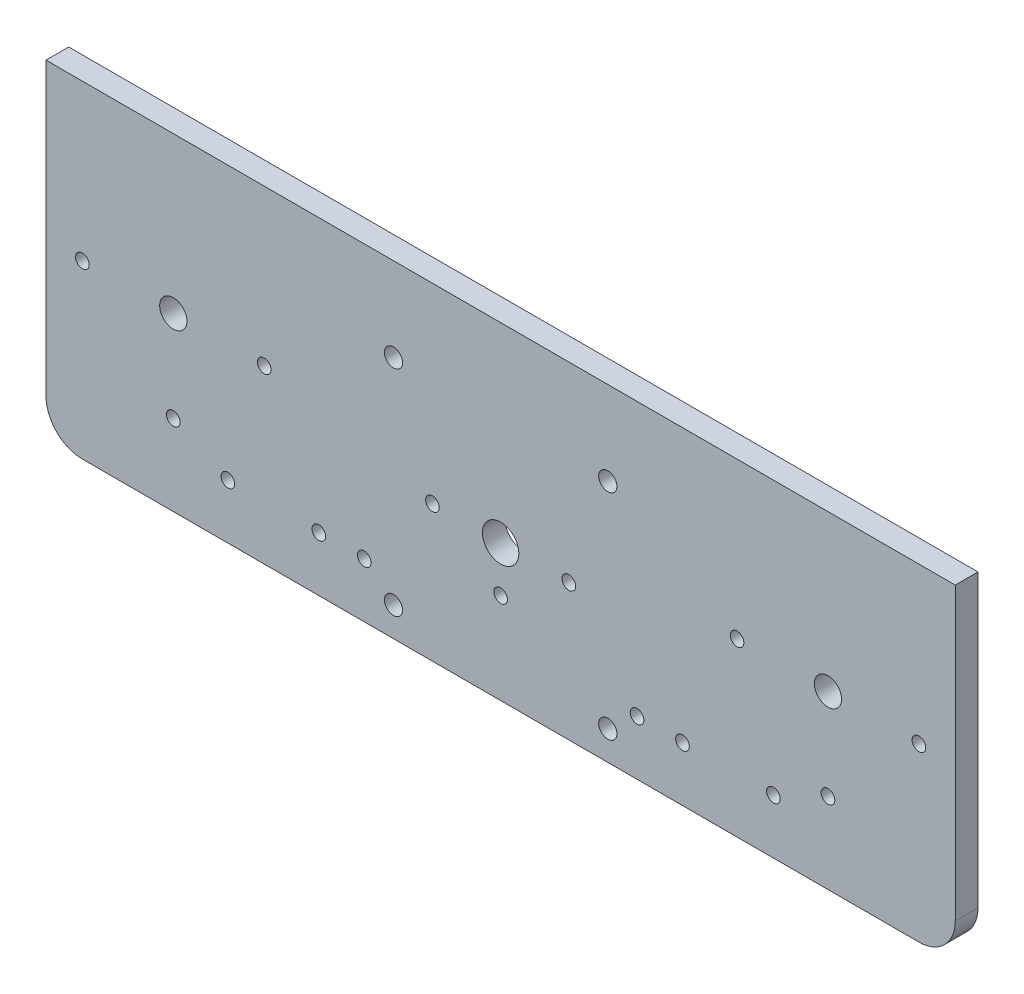
ISO-10303-21;
HEADER;
FILE_DESCRIPTION(('STEP AP214'),'2;1');
FILE_NAME('part.step','',(''),(''),'','','');
FILE_SCHEMA(('AUTOMOTIVE_DESIGN { 1 0 10303 214 1 1 1 1 }'));
ENDSEC;
DATA;
#1=APPLICATION_CONTEXT('core data for automotive mechanical design processes');
#2=APPLICATION_PROTOCOL_DEFINITION('international standard','automotive_design',2000,#1);
#3=PRODUCT_CONTEXT('',#1,'mechanical');
#4=PRODUCT('Part','Part','',(#3));
#5=PRODUCT_RELATED_PRODUCT_CATEGORY('part','',(#4));
#6=PRODUCT_DEFINITION_FORMATION('','',#4);
#7=PRODUCT_DEFINITION_CONTEXT('part definition',#1,'design');
#8=PRODUCT_DEFINITION('design','',#6,#7);
#9=PRODUCT_DEFINITION_SHAPE('','',#8);
#10=(LENGTH_UNIT() NAMED_UNIT(*) SI_UNIT(.MILLI.,.METRE.));
#11=(NAMED_UNIT(*) PLANE_ANGLE_UNIT() SI_UNIT($,.RADIAN.));
#12=(NAMED_UNIT(*) SI_UNIT($,.STERADIAN.) SOLID_ANGLE_UNIT());
#13=UNCERTAINTY_MEASURE_WITH_UNIT(LENGTH_MEASURE(1.E-05),#10,'distance_accuracy_value','');
#14=(GEOMETRIC_REPRESENTATION_CONTEXT(3) GLOBAL_UNCERTAINTY_ASSIGNED_CONTEXT((#13)) GLOBAL_UNIT_ASSIGNED_CONTEXT((#10,
#11,#12)) REPRESENTATION_CONTEXT('',''));
#15=CARTESIAN_POINT('',(0.,0.,0.));
#16=DIRECTION('',(0.,0.,1.));
#17=DIRECTION('',(1.,0.,0.));
#18=AXIS2_PLACEMENT_3D('',#15,#16,#17);
#19=CARTESIAN_POINT('',(-97.9315128409912,0.,5.));
#20=DIRECTION('',(1.,0.,0.));
#21=DIRECTION('',(0.,0.,-1.));
#22=AXIS2_PLACEMENT_3D('',#19,#20,#21);
#23=PLANE('',#22);
#24=DIRECTION('',(0.,-1.,0.));
#25=VECTOR('',#24,1.);
#26=CARTESIAN_POINT('',(-97.9315128409912,0.,0.));
#27=LINE('',#26,#25);
#28=CARTESIAN_POINT('',(-97.9315128409912,14.6727220693358,0.));
#29=VERTEX_POINT('',#28);
#30=CARTESIAN_POINT('',(-97.9315128409912,-49.3272779306642,0.));
#31=VERTEX_POINT('',#30);
#32=EDGE_CURVE('E220',#29,#31,#27,.T.);
#33=ORIENTED_EDGE('',*,*,#32,.T.);
#34=DIRECTION('',(0.,0.,-1.));
#35=VECTOR('',#34,1.);
#36=CARTESIAN_POINT('',(-97.9315128409912,-49.3272779306642,5.));
#37=LINE('',#36,#35);
#38=CARTESIAN_POINT('',(-97.9315128409912,-49.3272779306642,5.));
#39=VERTEX_POINT('',#38);
#40=EDGE_CURVE('E11',#39,#31,#37,.T.);
#41=ORIENTED_EDGE('',*,*,#40,.F.);
#42=DIRECTION('',(0.,-1.,0.));
#43=VECTOR('',#42,1.);
#44=CARTESIAN_POINT('',(-97.9315128409912,0.,5.));
#45=LINE('',#44,#43);
#46=CARTESIAN_POINT('',(-97.9315128409912,14.6727220693358,5.));
#47=VERTEX_POINT('',#46);
#48=EDGE_CURVE('E707',#47,#39,#45,.T.);
#49=ORIENTED_EDGE('',*,*,#48,.F.);
#50=DIRECTION('',(0.,0.,-1.));
#51=VECTOR('',#50,1.);
#52=CARTESIAN_POINT('',(-97.9315128409912,14.6727220693358,5.));
#53=LINE('',#52,#51);
#54=EDGE_CURVE('E59',#47,#29,#53,.T.);
#55=ORIENTED_EDGE('',*,*,#54,.T.);
#56=EDGE_LOOP('',(#33,#41,#49,#55));
#57=FACE_BOUND('',#56,.T.);
#58=ADVANCED_FACE('F41',(#57),#23,.F.);
#59=CARTESIAN_POINT('',(-89.9315128409912,-49.3272779306642,5.));
#60=DIRECTION('',(0.,0.,-1.));
#61=DIRECTION('',(-1.,0.,0.));
#62=AXIS2_PLACEMENT_3D('',#59,#60,#61);
#63=CYLINDRICAL_SURFACE('',#62,8.);
#64=CARTESIAN_POINT('',(-89.9315128409912,-49.3272779306642,0.));
#65=DIRECTION('',(0.,0.,1.));
#66=DIRECTION('',(1.,0.,0.));
#67=AXIS2_PLACEMENT_3D('',#64,#65,#66);
#68=CIRCLE('',#67,8.);
#69=CARTESIAN_POINT('',(-89.9315128409912,-57.3272779306642,0.));
#70=VERTEX_POINT('',#69);
#71=EDGE_CURVE('E223',#31,#70,#68,.T.);
#72=ORIENTED_EDGE('',*,*,#71,.T.);
#73=DIRECTION('',(0.,0.,-1.));
#74=VECTOR('',#73,1.);
#75=CARTESIAN_POINT('',(-89.9315128409912,-57.3272779306642,5.));
#76=LINE('',#75,#74);
#77=CARTESIAN_POINT('',(-89.9315128409912,-57.3272779306642,5.));
#78=VERTEX_POINT('',#77);
#79=EDGE_CURVE('E51',#78,#70,#76,.T.);
#80=ORIENTED_EDGE('',*,*,#79,.F.);
#81=CARTESIAN_POINT('',(-89.9315128409912,-49.3272779306642,5.));
#82=DIRECTION('',(0.,0.,1.));
#83=DIRECTION('',(1.,0.,0.));
#84=AXIS2_PLACEMENT_3D('',#81,#82,#83);
#85=CIRCLE('',#84,8.);
#86=EDGE_CURVE('E91',#39,#78,#85,.T.);
#87=ORIENTED_EDGE('',*,*,#86,.F.);
#88=ORIENTED_EDGE('',*,*,#40,.T.);
#89=EDGE_LOOP('',(#72,#80,#87,#88));
#90=FACE_BOUND('',#89,.T.);
#91=ADVANCED_FACE('F274',(#90),#63,.T.);
#92=CARTESIAN_POINT('',(0.,-57.3272779306642,5.));
#93=DIRECTION('',(0.,-1.,0.));
#94=DIRECTION('',(1.,0.,0.));
#95=AXIS2_PLACEMENT_3D('',#92,#93,#94);
#96=PLANE('',#95);
#97=DIRECTION('',(-1.,0.,0.));
#98=VECTOR('',#97,1.);
#99=CARTESIAN_POINT('',(0.,-57.3272779306642,0.));
#100=LINE('',#99,#98);
#101=CARTESIAN_POINT('',(94.0684871590088,-57.3272779306642,0.));
#102=VERTEX_POINT('',#101);
#103=EDGE_CURVE('E227',#102,#70,#100,.T.);
#104=ORIENTED_EDGE('',*,*,#103,.F.);
#105=DIRECTION('',(0.,0.,-1.));
#106=VECTOR('',#105,1.);
#107=CARTESIAN_POINT('',(94.0684871590088,-57.3272779306642,5.));
#108=LINE('',#107,#106);
#109=CARTESIAN_POINT('',(94.0684871590088,-57.3272779306642,5.));
#110=VERTEX_POINT('',#109);
#111=EDGE_CURVE('E111',#110,#102,#108,.T.);
#112=ORIENTED_EDGE('',*,*,#111,.F.);
#113=DIRECTION('',(-1.,0.,0.));
#114=VECTOR('',#113,1.);
#115=CARTESIAN_POINT('',(0.,-57.3272779306642,5.));
#116=LINE('',#115,#114);
#117=EDGE_CURVE('E121',#110,#78,#116,.T.);
#118=ORIENTED_EDGE('',*,*,#117,.T.);
#119=ORIENTED_EDGE('',*,*,#79,.T.);
#120=EDGE_LOOP('',(#104,#112,#118,#119));
#121=FACE_BOUND('',#120,.T.);
#122=ADVANCED_FACE('F273',(#121),#96,.T.);
#123=CARTESIAN_POINT('',(94.0684871590088,-49.3272779306642,5.));
#124=DIRECTION('',(0.,0.,-1.));
#125=DIRECTION('',(-1.,0.,0.));
#126=AXIS2_PLACEMENT_3D('',#123,#124,#125);
#127=CYLINDRICAL_SURFACE('',#126,8.);
#128=CARTESIAN_POINT('',(94.0684871590088,-49.3272779306642,0.));
#129=DIRECTION('',(0.,0.,1.));
#130=DIRECTION('',(1.,0.,0.));
#131=AXIS2_PLACEMENT_3D('',#128,#129,#130);
#132=CIRCLE('',#131,8.);
#133=CARTESIAN_POINT('',(102.068487159009,-49.3272779306642,0.));
#134=VERTEX_POINT('',#133);
#135=EDGE_CURVE('E106',#134,#102,#132,.F.);
#136=ORIENTED_EDGE('',*,*,#135,.F.);
#137=DIRECTION('',(0.,0.,-1.));
#138=VECTOR('',#137,1.);
#139=CARTESIAN_POINT('',(102.068487159009,-49.3272779306642,5.));
#140=LINE('',#139,#138);
#141=CARTESIAN_POINT('',(102.068487159009,-49.3272779306642,5.));
#142=VERTEX_POINT('',#141);
#143=EDGE_CURVE('E101',#142,#134,#140,.T.);
#144=ORIENTED_EDGE('',*,*,#143,.F.);
#145=CARTESIAN_POINT('',(94.0684871590088,-49.3272779306642,5.));
#146=DIRECTION('',(0.,0.,1.));
#147=DIRECTION('',(1.,0.,0.));
#148=AXIS2_PLACEMENT_3D('',#145,#146,#147);
#149=CIRCLE('',#148,8.);
#150=EDGE_CURVE('E104',#142,#110,#149,.F.);
#151=ORIENTED_EDGE('',*,*,#150,.T.);
#152=ORIENTED_EDGE('',*,*,#111,.T.);
#153=EDGE_LOOP('',(#136,#144,#151,#152));
#154=FACE_BOUND('',#153,.T.);
#155=ADVANCED_FACE('F103',(#154),#127,.T.);
#156=CARTESIAN_POINT('',(102.068487159009,0.,5.));
#157=DIRECTION('',(1.,0.,0.));
#158=DIRECTION('',(0.,0.,-1.));
#159=AXIS2_PLACEMENT_3D('',#156,#157,#158);
#160=PLANE('',#159);
#161=DIRECTION('',(0.,-1.,0.));
#162=VECTOR('',#161,1.);
#163=CARTESIAN_POINT('',(102.068487159009,0.,0.));
#164=LINE('',#163,#162);
#165=CARTESIAN_POINT('',(102.068487159009,14.6727220693358,0.));
#166=VERTEX_POINT('',#165);
#167=EDGE_CURVE('E233',#166,#134,#164,.T.);
#168=ORIENTED_EDGE('',*,*,#167,.F.);
#169=DIRECTION('',(0.,0.,-1.));
#170=VECTOR('',#169,1.);
#171=CARTESIAN_POINT('',(102.068487159009,14.6727220693358,5.));
#172=LINE('',#171,#170);
#173=CARTESIAN_POINT('',(102.068487159009,14.6727220693358,5.));
#174=VERTEX_POINT('',#173);
#175=EDGE_CURVE('E79',#174,#166,#172,.T.);
#176=ORIENTED_EDGE('',*,*,#175,.F.);
#177=DIRECTION('',(0.,-1.,0.));
#178=VECTOR('',#177,1.);
#179=CARTESIAN_POINT('',(102.068487159009,0.,5.));
#180=LINE('',#179,#178);
#181=EDGE_CURVE('E119',#174,#142,#180,.T.);
#182=ORIENTED_EDGE('',*,*,#181,.T.);
#183=ORIENTED_EDGE('',*,*,#143,.T.);
#184=EDGE_LOOP('',(#168,#176,#182,#183));
#185=FACE_BOUND('',#184,.T.);
#186=ADVANCED_FACE('F124',(#185),#160,.T.);
#187=CARTESIAN_POINT('',(32.0684871590088,-45.3272779306642,5.));
#188=DIRECTION('',(0.,0.,-1.));
#189=DIRECTION('',(-1.,0.,0.));
#190=AXIS2_PLACEMENT_3D('',#187,#188,#189);
#191=CYLINDRICAL_SURFACE('',#190,1.5);
#192=CARTESIAN_POINT('',(32.0684871590088,-45.3272779306642,5.));
#193=DIRECTION('',(0.,0.,1.));
#194=DIRECTION('',(1.,0.,0.));
#195=AXIS2_PLACEMENT_3D('',#192,#193,#194);
#196=CIRCLE('',#195,1.5);
#197=CARTESIAN_POINT('',(33.5684871590088,-45.3272779306642,5.));
#198=VERTEX_POINT('',#197);
#199=EDGE_CURVE('E148',#198,#198,#196,.T.);
#200=ORIENTED_EDGE('',*,*,#199,.T.);
#201=EDGE_LOOP('',(#200));
#202=FACE_BOUND('',#201,.T.);
#203=CARTESIAN_POINT('',(32.0684871590088,-45.3272779306642,0.));
#204=DIRECTION('',(0.,0.,1.));
#205=DIRECTION('',(1.,0.,0.));
#206=AXIS2_PLACEMENT_3D('',#203,#204,#205);
#207=CIRCLE('',#206,1.5);
#208=CARTESIAN_POINT('',(33.5684871590088,-45.3272779306642,0.));
#209=VERTEX_POINT('',#208);
#210=EDGE_CURVE('E256',#209,#209,#207,.T.);
#211=ORIENTED_EDGE('',*,*,#210,.F.);
#212=EDGE_LOOP('',(#211));
#213=FACE_BOUND('',#212,.T.);
#214=ADVANCED_FACE('F422',(#202,#213),#191,.F.);
#215=CARTESIAN_POINT('',(25.6384871590088,-3.75727793066421,5.));
#216=DIRECTION('',(0.,0.,-1.));
#217=DIRECTION('',(-1.,0.,0.));
#218=AXIS2_PLACEMENT_3D('',#215,#216,#217);
#219=CYLINDRICAL_SURFACE('',#218,2.);
#220=CARTESIAN_POINT('',(25.6384871590088,-3.75727793066421,5.));
#221=DIRECTION('',(0.,0.,1.));
#222=DIRECTION('',(1.,0.,0.));
#223=AXIS2_PLACEMENT_3D('',#220,#221,#222);
#224=CIRCLE('',#223,2.);
#225=CARTESIAN_POINT('',(27.6384871590088,-3.75727793066421,5.));
#226=VERTEX_POINT('',#225);
#227=EDGE_CURVE('E144',#226,#226,#224,.F.);
#228=ORIENTED_EDGE('',*,*,#227,.F.);
#229=EDGE_LOOP('',(#228));
#230=FACE_BOUND('',#229,.T.);
#231=CARTESIAN_POINT('',(25.6384871590088,-3.75727793066421,0.));
#232=DIRECTION('',(0.,0.,1.));
#233=DIRECTION('',(1.,0.,0.));
#234=AXIS2_PLACEMENT_3D('',#231,#232,#233);
#235=CIRCLE('',#234,2.);
#236=CARTESIAN_POINT('',(27.6384871590088,-3.75727793066421,0.));
#237=VERTEX_POINT('',#236);
#238=EDGE_CURVE('E252',#237,#237,#235,.F.);
#239=ORIENTED_EDGE('',*,*,#238,.T.);
#240=EDGE_LOOP('',(#239));
#241=FACE_BOUND('',#240,.T.);
#242=ADVANCED_FACE('F425',(#230,#241),#219,.F.);
#243=CARTESIAN_POINT('',(-21.5015128409912,-3.75727793066421,5.));
#244=DIRECTION('',(0.,0.,-1.));
#245=DIRECTION('',(-1.,0.,0.));
#246=AXIS2_PLACEMENT_3D('',#243,#244,#245);
#247=CYLINDRICAL_SURFACE('',#246,2.);
#248=CARTESIAN_POINT('',(-21.5015128409912,-3.75727793066421,5.));
#249=DIRECTION('',(0.,0.,1.));
#250=DIRECTION('',(1.,0.,0.));
#251=AXIS2_PLACEMENT_3D('',#248,#249,#250);
#252=CIRCLE('',#251,2.);
#253=CARTESIAN_POINT('',(-19.5015128409912,-3.75727793066421,5.));
#254=VERTEX_POINT('',#253);
#255=EDGE_CURVE('E140',#254,#254,#252,.T.);
#256=ORIENTED_EDGE('',*,*,#255,.T.);
#257=EDGE_LOOP('',(#256));
#258=FACE_BOUND('',#257,.T.);
#259=CARTESIAN_POINT('',(-21.5015128409912,-3.75727793066421,0.));
#260=DIRECTION('',(0.,0.,1.));
#261=DIRECTION('',(1.,0.,0.));
#262=AXIS2_PLACEMENT_3D('',#259,#260,#261);
#263=CIRCLE('',#262,2.);
#264=CARTESIAN_POINT('',(-19.5015128409912,-3.75727793066421,0.));
#265=VERTEX_POINT('',#264);
#266=EDGE_CURVE('E248',#265,#265,#263,.T.);
#267=ORIENTED_EDGE('',*,*,#266,.F.);
#268=EDGE_LOOP('',(#267));
#269=FACE_BOUND('',#268,.T.);
#270=ADVANCED_FACE('F429',(#258,#269),#247,.F.);
#271=CARTESIAN_POINT('',(2.06848715900879,-37.3272779306642,5.));
#272=DIRECTION('',(0.,0.,-1.));
#273=DIRECTION('',(-1.,0.,0.));
#274=AXIS2_PLACEMENT_3D('',#271,#272,#273);
#275=CYLINDRICAL_SURFACE('',#274,1.5);
#276=CARTESIAN_POINT('',(2.06848715900879,-37.3272779306642,5.));
#277=DIRECTION('',(0.,0.,1.));
#278=DIRECTION('',(1.,0.,0.));
#279=AXIS2_PLACEMENT_3D('',#276,#277,#278);
#280=CIRCLE('',#279,1.5);
#281=CARTESIAN_POINT('',(3.56848715900879,-37.3272779306642,5.));
#282=VERTEX_POINT('',#281);
#283=EDGE_CURVE('E136',#282,#282,#280,.T.);
#284=ORIENTED_EDGE('',*,*,#283,.T.);
#285=EDGE_LOOP('',(#284));
#286=FACE_BOUND('',#285,.T.);
#287=CARTESIAN_POINT('',(2.06848715900879,-37.3272779306642,0.));
#288=DIRECTION('',(0.,0.,1.));
#289=DIRECTION('',(1.,0.,0.));
#290=AXIS2_PLACEMENT_3D('',#287,#288,#289);
#291=CIRCLE('',#290,1.5);
#292=CARTESIAN_POINT('',(3.56848715900879,-37.3272779306642,0.));
#293=VERTEX_POINT('',#292);
#294=EDGE_CURVE('E244',#293,#293,#291,.T.);
#295=ORIENTED_EDGE('',*,*,#294,.F.);
#296=EDGE_LOOP('',(#295));
#297=FACE_BOUND('',#296,.T.);
#298=ADVANCED_FACE('F291',(#286,#297),#275,.F.);
#299=CARTESIAN_POINT('',(-37.9315128409912,-45.3272779306642,5.));
#300=DIRECTION('',(0.,0.,-1.));
#301=DIRECTION('',(-1.,0.,0.));
#302=AXIS2_PLACEMENT_3D('',#299,#300,#301);
#303=CYLINDRICAL_SURFACE('',#302,1.5);
#304=CARTESIAN_POINT('',(-37.9315128409912,-45.3272779306642,5.));
#305=DIRECTION('',(0.,0.,1.));
#306=DIRECTION('',(1.,0.,0.));
#307=AXIS2_PLACEMENT_3D('',#304,#305,#306);
#308=CIRCLE('',#307,1.5);
#309=CARTESIAN_POINT('',(-36.4315128409912,-45.3272779306642,5.));
#310=VERTEX_POINT('',#309);
#311=EDGE_CURVE('E129',#310,#310,#308,.F.);
#312=ORIENTED_EDGE('',*,*,#311,.F.);
#313=EDGE_LOOP('',(#312));
#314=FACE_BOUND('',#313,.T.);
#315=CARTESIAN_POINT('',(-37.9315128409912,-45.3272779306642,0.));
#316=DIRECTION('',(0.,0.,1.));
#317=DIRECTION('',(1.,0.,0.));
#318=AXIS2_PLACEMENT_3D('',#315,#316,#317);
#319=CIRCLE('',#318,1.5);
#320=CARTESIAN_POINT('',(-36.4315128409912,-45.3272779306642,0.));
#321=VERTEX_POINT('',#320);
#322=EDGE_CURVE('E240',#321,#321,#319,.F.);
#323=ORIENTED_EDGE('',*,*,#322,.T.);
#324=EDGE_LOOP('',(#323));
#325=FACE_BOUND('',#324,.T.);
#326=ADVANCED_FACE('F282',(#314,#325),#303,.F.);
#327=CARTESIAN_POINT('',(0.,14.6727220693358,5.));
#328=DIRECTION('',(0.,1.,0.));
#329=DIRECTION('',(0.,0.,1.));
#330=AXIS2_PLACEMENT_3D('',#327,#328,#329);
#331=PLANE('',#330);
#332=DIRECTION('',(1.,0.,0.));
#333=VECTOR('',#332,1.);
#334=CARTESIAN_POINT('',(0.,14.6727220693358,0.));
#335=LINE('',#334,#333);
#336=EDGE_CURVE('E236',#29,#166,#335,.T.);
#337=ORIENTED_EDGE('',*,*,#336,.F.);
#338=ORIENTED_EDGE('',*,*,#54,.F.);
#339=DIRECTION('',(1.,0.,0.));
#340=VECTOR('',#339,1.);
#341=CARTESIAN_POINT('',(0.,14.6727220693358,5.));
#342=LINE('',#341,#340);
#343=EDGE_CURVE('E126',#47,#174,#342,.T.);
#344=ORIENTED_EDGE('',*,*,#343,.T.);
#345=ORIENTED_EDGE('',*,*,#175,.T.);
#346=EDGE_LOOP('',(#337,#338,#344,#345));
#347=FACE_BOUND('',#346,.T.);
#348=ADVANCED_FACE('F279',(#347),#331,.T.);
#349=CARTESIAN_POINT('',(-69.9315128409912,-39.5772779306642,5.));
#350=DIRECTION('',(0.,0.,-1.));
#351=DIRECTION('',(-1.,0.,0.));
#352=AXIS2_PLACEMENT_3D('',#349,#350,#351);
#353=CYLINDRICAL_SURFACE('',#352,1.5);
#354=CARTESIAN_POINT('',(-69.9315128409912,-39.5772779306642,5.));
#355=DIRECTION('',(0.,0.,1.));
#356=DIRECTION('',(1.,0.,0.));
#357=AXIS2_PLACEMENT_3D('',#354,#355,#356);
#358=CIRCLE('',#357,1.5);
#359=CARTESIAN_POINT('',(-68.4315128409912,-39.5772779306642,5.));
#360=VERTEX_POINT('',#359);
#361=EDGE_CURVE('E705',#360,#360,#358,.F.);
#362=ORIENTED_EDGE('',*,*,#361,.F.);
#363=EDGE_LOOP('',(#362));
#364=FACE_BOUND('',#363,.T.);
#365=CARTESIAN_POINT('',(-69.9315128409912,-39.5772779306642,0.));
#366=DIRECTION('',(0.,0.,1.));
#367=DIRECTION('',(1.,0.,0.));
#368=AXIS2_PLACEMENT_3D('',#365,#366,#367);
#369=CIRCLE('',#368,1.5);
#370=CARTESIAN_POINT('',(-68.4315128409912,-39.5772779306642,0.));
#371=VERTEX_POINT('',#370);
#372=EDGE_CURVE('E216',#371,#371,#369,.F.);
#373=ORIENTED_EDGE('',*,*,#372,.T.);
#374=EDGE_LOOP('',(#373));
#375=FACE_BOUND('',#374,.T.);
#376=ADVANCED_FACE('F281',(#364,#375),#353,.F.);
#377=CARTESIAN_POINT('',(-69.9315128409912,-19.5772779306642,5.));
#378=DIRECTION('',(0.,0.,-1.));
#379=DIRECTION('',(-1.,0.,0.));
#380=AXIS2_PLACEMENT_3D('',#377,#378,#379);
#381=CYLINDRICAL_SURFACE('',#380,3.00000000000001);
#382=CARTESIAN_POINT('',(-69.9315128409912,-19.5772779306642,5.));
#383=DIRECTION('',(0.,0.,1.));
#384=DIRECTION('',(1.,0.,0.));
#385=AXIS2_PLACEMENT_3D('',#382,#383,#384);
#386=CIRCLE('',#385,3.00000000000001);
#387=CARTESIAN_POINT('',(-66.9315128409912,-19.5772779306642,5.));
#388=VERTEX_POINT('',#387);
#389=EDGE_CURVE('E702',#388,#388,#386,.F.);
#390=ORIENTED_EDGE('',*,*,#389,.F.);
#391=EDGE_LOOP('',(#390));
#392=FACE_BOUND('',#391,.T.);
#393=CARTESIAN_POINT('',(-69.9315128409912,-19.5772779306642,0.));
#394=DIRECTION('',(0.,0.,1.));
#395=DIRECTION('',(1.,0.,0.));
#396=AXIS2_PLACEMENT_3D('',#393,#394,#395);
#397=CIRCLE('',#396,3.00000000000001);
#398=CARTESIAN_POINT('',(-66.9315128409912,-19.5772779306642,0.));
#399=VERTEX_POINT('',#398);
#400=EDGE_CURVE('E212',#399,#399,#397,.F.);
#401=ORIENTED_EDGE('',*,*,#400,.T.);
#402=EDGE_LOOP('',(#401));
#403=FACE_BOUND('',#402,.T.);
#404=ADVANCED_FACE('F288',(#392,#403),#381,.F.);
#405=CARTESIAN_POINT('',(74.0684871590088,-19.5772779306642,5.));
#406=DIRECTION('',(0.,0.,-1.));
#407=DIRECTION('',(-1.,0.,0.));
#408=AXIS2_PLACEMENT_3D('',#405,#406,#407);
#409=CYLINDRICAL_SURFACE('',#408,3.00000000000001);
#410=CARTESIAN_POINT('',(74.0684871590088,-19.5772779306642,5.));
#411=DIRECTION('',(0.,0.,1.));
#412=DIRECTION('',(1.,0.,0.));
#413=AXIS2_PLACEMENT_3D('',#410,#411,#412);
#414=CIRCLE('',#413,3.00000000000001);
#415=CARTESIAN_POINT('',(77.0684871590088,-19.5772779306642,5.));
#416=VERTEX_POINT('',#415);
#417=EDGE_CURVE('E698',#416,#416,#414,.T.);
#418=ORIENTED_EDGE('',*,*,#417,.T.);
#419=EDGE_LOOP('',(#418));
#420=FACE_BOUND('',#419,.T.);
#421=CARTESIAN_POINT('',(74.0684871590088,-19.5772779306642,0.));
#422=DIRECTION('',(0.,0.,1.));
#423=DIRECTION('',(1.,0.,0.));
#424=AXIS2_PLACEMENT_3D('',#421,#422,#423);
#425=CIRCLE('',#424,3.00000000000001);
#426=CARTESIAN_POINT('',(77.0684871590088,-19.5772779306642,0.));
#427=VERTEX_POINT('',#426);
#428=EDGE_CURVE('E208',#427,#427,#425,.T.);
#429=ORIENTED_EDGE('',*,*,#428,.F.);
#430=EDGE_LOOP('',(#429));
#431=FACE_BOUND('',#430,.T.);
#432=ADVANCED_FACE('F305',(#420,#431),#409,.F.);
#433=CARTESIAN_POINT('',(2.06848715900879,-27.3272779306642,5.));
#434=DIRECTION('',(0.,0.,-1.));
#435=DIRECTION('',(-1.,0.,0.));
#436=AXIS2_PLACEMENT_3D('',#433,#434,#435);
#437=CYLINDRICAL_SURFACE('',#436,4.);
#438=CARTESIAN_POINT('',(2.06848715900879,-27.3272779306642,5.));
#439=DIRECTION('',(0.,0.,1.));
#440=DIRECTION('',(1.,0.,0.));
#441=AXIS2_PLACEMENT_3D('',#438,#439,#440);
#442=CIRCLE('',#441,4.);
#443=CARTESIAN_POINT('',(6.06848715900879,-27.3272779306642,5.));
#444=VERTEX_POINT('',#443);
#445=EDGE_CURVE('E694',#444,#444,#442,.T.);
#446=ORIENTED_EDGE('',*,*,#445,.T.);
#447=EDGE_LOOP('',(#446));
#448=FACE_BOUND('',#447,.T.);
#449=CARTESIAN_POINT('',(2.06848715900879,-27.3272779306642,0.));
#450=DIRECTION('',(0.,0.,1.));
#451=DIRECTION('',(1.,0.,0.));
#452=AXIS2_PLACEMENT_3D('',#449,#450,#451);
#453=CIRCLE('',#452,4.);
#454=CARTESIAN_POINT('',(6.06848715900879,-27.3272779306642,0.));
#455=VERTEX_POINT('',#454);
#456=EDGE_CURVE('E204',#455,#455,#453,.T.);
#457=ORIENTED_EDGE('',*,*,#456,.F.);
#458=EDGE_LOOP('',(#457));
#459=FACE_BOUND('',#458,.T.);
#460=ADVANCED_FACE('F309',(#448,#459),#437,.F.);
#461=CARTESIAN_POINT('',(74.0684871590088,-39.5772779306642,5.));
#462=DIRECTION('',(0.,0.,-1.));
#463=DIRECTION('',(-1.,0.,0.));
#464=AXIS2_PLACEMENT_3D('',#461,#462,#463);
#465=CYLINDRICAL_SURFACE('',#464,1.5);
#466=CARTESIAN_POINT('',(74.0684871590088,-39.5772779306642,5.));
#467=DIRECTION('',(0.,0.,1.));
#468=DIRECTION('',(1.,0.,0.));
#469=AXIS2_PLACEMENT_3D('',#466,#467,#468);
#470=CIRCLE('',#469,1.5);
#471=CARTESIAN_POINT('',(75.5684871590088,-39.5772779306642,5.));
#472=VERTEX_POINT('',#471);
#473=EDGE_CURVE('E690',#472,#472,#470,.T.);
#474=ORIENTED_EDGE('',*,*,#473,.T.);
#475=EDGE_LOOP('',(#474));
#476=FACE_BOUND('',#475,.T.);
#477=CARTESIAN_POINT('',(74.0684871590088,-39.5772779306642,0.));
#478=DIRECTION('',(0.,0.,1.));
#479=DIRECTION('',(1.,0.,0.));
#480=AXIS2_PLACEMENT_3D('',#477,#478,#479);
#481=CIRCLE('',#480,1.5);
#482=CARTESIAN_POINT('',(75.5684871590088,-39.5772779306642,0.));
#483=VERTEX_POINT('',#482);
#484=EDGE_CURVE('E200',#483,#483,#481,.T.);
#485=ORIENTED_EDGE('',*,*,#484,.F.);
#486=EDGE_LOOP('',(#485));
#487=FACE_BOUND('',#486,.T.);
#488=ADVANCED_FACE('F313',(#476,#487),#465,.F.);
#489=CARTESIAN_POINT('',(54.0684871590088,-19.5772779306642,5.));
#490=DIRECTION('',(0.,0.,-1.));
#491=DIRECTION('',(-1.,0.,0.));
#492=AXIS2_PLACEMENT_3D('',#489,#490,#491);
#493=CYLINDRICAL_SURFACE('',#492,1.5);
#494=CARTESIAN_POINT('',(54.0684871590088,-19.5772779306642,5.));
#495=DIRECTION('',(0.,0.,1.));
#496=DIRECTION('',(1.,0.,0.));
#497=AXIS2_PLACEMENT_3D('',#494,#495,#496);
#498=CIRCLE('',#497,1.5);
#499=CARTESIAN_POINT('',(55.5684871590088,-19.5772779306642,5.));
#500=VERTEX_POINT('',#499);
#501=EDGE_CURVE('E686',#500,#500,#498,.T.);
#502=ORIENTED_EDGE('',*,*,#501,.T.);
#503=EDGE_LOOP('',(#502));
#504=FACE_BOUND('',#503,.T.);
#505=CARTESIAN_POINT('',(54.0684871590088,-19.5772779306642,0.));
#506=DIRECTION('',(0.,0.,1.));
#507=DIRECTION('',(1.,0.,0.));
#508=AXIS2_PLACEMENT_3D('',#505,#506,#507);
#509=CIRCLE('',#508,1.5);
#510=CARTESIAN_POINT('',(55.5684871590088,-19.5772779306642,0.));
#511=VERTEX_POINT('',#510);
#512=EDGE_CURVE('E196',#511,#511,#509,.T.);
#513=ORIENTED_EDGE('',*,*,#512,.F.);
#514=EDGE_LOOP('',(#513));
#515=FACE_BOUND('',#514,.T.);
#516=ADVANCED_FACE('F317',(#504,#515),#493,.F.);
#517=CARTESIAN_POINT('',(94.0684871590088,-19.5772779306642,5.));
#518=DIRECTION('',(0.,0.,-1.));
#519=DIRECTION('',(-1.,0.,0.));
#520=AXIS2_PLACEMENT_3D('',#517,#518,#519);
#521=CYLINDRICAL_SURFACE('',#520,1.5);
#522=CARTESIAN_POINT('',(94.0684871590088,-19.5772779306642,5.));
#523=DIRECTION('',(0.,0.,1.));
#524=DIRECTION('',(1.,0.,0.));
#525=AXIS2_PLACEMENT_3D('',#522,#523,#524);
#526=CIRCLE('',#525,1.5);
#527=CARTESIAN_POINT('',(95.5684871590088,-19.5772779306642,5.));
#528=VERTEX_POINT('',#527);
#529=EDGE_CURVE('E682',#528,#528,#526,.F.);
#530=ORIENTED_EDGE('',*,*,#529,.F.);
#531=EDGE_LOOP('',(#530));
#532=FACE_BOUND('',#531,.T.);
#533=CARTESIAN_POINT('',(94.0684871590088,-19.5772779306642,0.));
#534=DIRECTION('',(0.,0.,1.));
#535=DIRECTION('',(1.,0.,0.));
#536=AXIS2_PLACEMENT_3D('',#533,#534,#535);
#537=CIRCLE('',#536,1.5);
#538=CARTESIAN_POINT('',(95.5684871590088,-19.5772779306642,0.));
#539=VERTEX_POINT('',#538);
#540=EDGE_CURVE('E192',#539,#539,#537,.F.);
#541=ORIENTED_EDGE('',*,*,#540,.T.);
#542=EDGE_LOOP('',(#541));
#543=FACE_BOUND('',#542,.T.);
#544=ADVANCED_FACE('F321',(#532,#543),#521,.F.);
#545=CARTESIAN_POINT('',(-89.9315128409912,-19.5772779306642,5.));
#546=DIRECTION('',(0.,0.,-1.));
#547=DIRECTION('',(-1.,0.,0.));
#548=AXIS2_PLACEMENT_3D('',#545,#546,#547);
#549=CYLINDRICAL_SURFACE('',#548,1.5);
#550=CARTESIAN_POINT('',(-89.9315128409912,-19.5772779306642,5.));
#551=DIRECTION('',(0.,0.,1.));
#552=DIRECTION('',(1.,0.,0.));
#553=AXIS2_PLACEMENT_3D('',#550,#551,#552);
#554=CIRCLE('',#553,1.5);
#555=CARTESIAN_POINT('',(-88.4315128409912,-19.5772779306642,5.));
#556=VERTEX_POINT('',#555);
#557=EDGE_CURVE('E678',#556,#556,#554,.T.);
#558=ORIENTED_EDGE('',*,*,#557,.T.);
#559=EDGE_LOOP('',(#558));
#560=FACE_BOUND('',#559,.T.);
#561=CARTESIAN_POINT('',(-89.9315128409912,-19.5772779306642,0.));
#562=DIRECTION('',(0.,0.,1.));
#563=DIRECTION('',(1.,0.,0.));
#564=AXIS2_PLACEMENT_3D('',#561,#562,#563);
#565=CIRCLE('',#564,1.5);
#566=CARTESIAN_POINT('',(-88.4315128409912,-19.5772779306642,0.));
#567=VERTEX_POINT('',#566);
#568=EDGE_CURVE('E188',#567,#567,#565,.T.);
#569=ORIENTED_EDGE('',*,*,#568,.F.);
#570=EDGE_LOOP('',(#569));
#571=FACE_BOUND('',#570,.T.);
#572=ADVANCED_FACE('F325',(#560,#571),#549,.F.);
#573=CARTESIAN_POINT('',(-49.9315128409912,-19.5772779306642,5.));
#574=DIRECTION('',(0.,0.,-1.));
#575=DIRECTION('',(-1.,0.,0.));
#576=AXIS2_PLACEMENT_3D('',#573,#574,#575);
#577=CYLINDRICAL_SURFACE('',#576,1.5);
#578=CARTESIAN_POINT('',(-49.9315128409912,-19.5772779306642,5.));
#579=DIRECTION('',(0.,0.,1.));
#580=DIRECTION('',(1.,0.,0.));
#581=AXIS2_PLACEMENT_3D('',#578,#579,#580);
#582=CIRCLE('',#581,1.5);
#583=CARTESIAN_POINT('',(-48.4315128409912,-19.5772779306642,5.));
#584=VERTEX_POINT('',#583);
#585=EDGE_CURVE('E674',#584,#584,#582,.F.);
#586=ORIENTED_EDGE('',*,*,#585,.F.);
#587=EDGE_LOOP('',(#586));
#588=FACE_BOUND('',#587,.T.);
#589=CARTESIAN_POINT('',(-49.9315128409912,-19.5772779306642,0.));
#590=DIRECTION('',(0.,0.,1.));
#591=DIRECTION('',(1.,0.,0.));
#592=AXIS2_PLACEMENT_3D('',#589,#590,#591);
#593=CIRCLE('',#592,1.5);
#594=CARTESIAN_POINT('',(-48.4315128409912,-19.5772779306642,0.));
#595=VERTEX_POINT('',#594);
#596=EDGE_CURVE('E184',#595,#595,#593,.F.);
#597=ORIENTED_EDGE('',*,*,#596,.T.);
#598=EDGE_LOOP('',(#597));
#599=FACE_BOUND('',#598,.T.);
#600=ADVANCED_FACE('F329',(#588,#599),#577,.F.);
#601=CARTESIAN_POINT('',(42.0684871590088,-45.3272779306642,5.));
#602=DIRECTION('',(0.,0.,-1.));
#603=DIRECTION('',(-1.,0.,0.));
#604=AXIS2_PLACEMENT_3D('',#601,#602,#603);
#605=CYLINDRICAL_SURFACE('',#604,1.5);
#606=CARTESIAN_POINT('',(42.0684871590088,-45.3272779306642,5.));
#607=DIRECTION('',(0.,0.,1.));
#608=DIRECTION('',(1.,0.,0.));
#609=AXIS2_PLACEMENT_3D('',#606,#607,#608);
#610=CIRCLE('',#609,1.5);
#611=CARTESIAN_POINT('',(43.5684871590088,-45.3272779306642,5.));
#612=VERTEX_POINT('',#611);
#613=EDGE_CURVE('E670',#612,#612,#610,.T.);
#614=ORIENTED_EDGE('',*,*,#613,.T.);
#615=EDGE_LOOP('',(#614));
#616=FACE_BOUND('',#615,.T.);
#617=CARTESIAN_POINT('',(42.0684871590088,-45.3272779306642,0.));
#618=DIRECTION('',(0.,0.,1.));
#619=DIRECTION('',(1.,0.,0.));
#620=AXIS2_PLACEMENT_3D('',#617,#618,#619);
#621=CIRCLE('',#620,1.5);
#622=CARTESIAN_POINT('',(43.5684871590088,-45.3272779306642,0.));
#623=VERTEX_POINT('',#622);
#624=EDGE_CURVE('E180',#623,#623,#621,.T.);
#625=ORIENTED_EDGE('',*,*,#624,.F.);
#626=EDGE_LOOP('',(#625));
#627=FACE_BOUND('',#626,.T.);
#628=ADVANCED_FACE('F333',(#616,#627),#605,.F.);
#629=CARTESIAN_POINT('',(62.0684871590088,-45.3272779306642,5.));
#630=DIRECTION('',(0.,0.,-1.));
#631=DIRECTION('',(-1.,0.,0.));
#632=AXIS2_PLACEMENT_3D('',#629,#630,#631);
#633=CYLINDRICAL_SURFACE('',#632,1.5);
#634=CARTESIAN_POINT('',(62.0684871590088,-45.3272779306642,5.));
#635=DIRECTION('',(0.,0.,1.));
#636=DIRECTION('',(1.,0.,0.));
#637=AXIS2_PLACEMENT_3D('',#634,#635,#636);
#638=CIRCLE('',#637,1.5);
#639=CARTESIAN_POINT('',(63.5684871590088,-45.3272779306642,5.));
#640=VERTEX_POINT('',#639);
#641=EDGE_CURVE('E666',#640,#640,#638,.T.);
#642=ORIENTED_EDGE('',*,*,#641,.T.);
#643=EDGE_LOOP('',(#642));
#644=FACE_BOUND('',#643,.T.);
#645=CARTESIAN_POINT('',(62.0684871590088,-45.3272779306642,0.));
#646=DIRECTION('',(0.,0.,1.));
#647=DIRECTION('',(1.,0.,0.));
#648=AXIS2_PLACEMENT_3D('',#645,#646,#647);
#649=CIRCLE('',#648,1.5);
#650=CARTESIAN_POINT('',(63.5684871590088,-45.3272779306642,0.));
#651=VERTEX_POINT('',#650);
#652=EDGE_CURVE('E176',#651,#651,#649,.T.);
#653=ORIENTED_EDGE('',*,*,#652,.F.);
#654=EDGE_LOOP('',(#653));
#655=FACE_BOUND('',#654,.T.);
#656=ADVANCED_FACE('F337',(#644,#655),#633,.F.);
#657=CARTESIAN_POINT('',(-57.9315128409912,-45.3272779306642,5.));
#658=DIRECTION('',(0.,0.,-1.));
#659=DIRECTION('',(-1.,0.,0.));
#660=AXIS2_PLACEMENT_3D('',#657,#658,#659);
#661=CYLINDRICAL_SURFACE('',#660,1.5);
#662=CARTESIAN_POINT('',(-57.9315128409912,-45.3272779306642,5.));
#663=DIRECTION('',(0.,0.,1.));
#664=DIRECTION('',(1.,0.,0.));
#665=AXIS2_PLACEMENT_3D('',#662,#663,#664);
#666=CIRCLE('',#665,1.5);
#667=CARTESIAN_POINT('',(-56.4315128409912,-45.3272779306642,5.));
#668=VERTEX_POINT('',#667);
#669=EDGE_CURVE('E662',#668,#668,#666,.F.);
#670=ORIENTED_EDGE('',*,*,#669,.F.);
#671=EDGE_LOOP('',(#670));
#672=FACE_BOUND('',#671,.T.);
#673=CARTESIAN_POINT('',(-57.9315128409912,-45.3272779306642,0.));
#674=DIRECTION('',(0.,0.,1.));
#675=DIRECTION('',(1.,0.,0.));
#676=AXIS2_PLACEMENT_3D('',#673,#674,#675);
#677=CIRCLE('',#676,1.5);
#678=CARTESIAN_POINT('',(-56.4315128409912,-45.3272779306642,0.));
#679=VERTEX_POINT('',#678);
#680=EDGE_CURVE('E172',#679,#679,#677,.F.);
#681=ORIENTED_EDGE('',*,*,#680,.T.);
#682=EDGE_LOOP('',(#681));
#683=FACE_BOUND('',#682,.T.);
#684=ADVANCED_FACE('F341',(#672,#683),#661,.F.);
#685=CARTESIAN_POINT('',(-12.9315128409912,-27.3272779306642,5.));
#686=DIRECTION('',(0.,0.,-1.));
#687=DIRECTION('',(-1.,0.,0.));
#688=AXIS2_PLACEMENT_3D('',#685,#686,#687);
#689=CYLINDRICAL_SURFACE('',#688,1.5);
#690=CARTESIAN_POINT('',(-12.9315128409912,-27.3272779306642,5.));
#691=DIRECTION('',(0.,0.,1.));
#692=DIRECTION('',(1.,0.,0.));
#693=AXIS2_PLACEMENT_3D('',#690,#691,#692);
#694=CIRCLE('',#693,1.5);
#695=CARTESIAN_POINT('',(-11.4315128409912,-27.3272779306642,5.));
#696=VERTEX_POINT('',#695);
#697=EDGE_CURVE('E658',#696,#696,#694,.T.);
#698=ORIENTED_EDGE('',*,*,#697,.T.);
#699=EDGE_LOOP('',(#698));
#700=FACE_BOUND('',#699,.T.);
#701=CARTESIAN_POINT('',(-12.9315128409912,-27.3272779306642,0.));
#702=DIRECTION('',(0.,0.,1.));
#703=DIRECTION('',(1.,0.,0.));
#704=AXIS2_PLACEMENT_3D('',#701,#702,#703);
#705=CIRCLE('',#704,1.5);
#706=CARTESIAN_POINT('',(-11.4315128409912,-27.3272779306642,0.));
#707=VERTEX_POINT('',#706);
#708=EDGE_CURVE('E168',#707,#707,#705,.T.);
#709=ORIENTED_EDGE('',*,*,#708,.F.);
#710=EDGE_LOOP('',(#709));
#711=FACE_BOUND('',#710,.T.);
#712=ADVANCED_FACE('F345',(#700,#711),#689,.F.);
#713=CARTESIAN_POINT('',(17.0684871590088,-27.3272779306642,5.));
#714=DIRECTION('',(0.,0.,-1.));
#715=DIRECTION('',(-1.,0.,0.));
#716=AXIS2_PLACEMENT_3D('',#713,#714,#715);
#717=CYLINDRICAL_SURFACE('',#716,1.5);
#718=CARTESIAN_POINT('',(17.0684871590088,-27.3272779306642,5.));
#719=DIRECTION('',(0.,0.,1.));
#720=DIRECTION('',(1.,0.,0.));
#721=AXIS2_PLACEMENT_3D('',#718,#719,#720);
#722=CIRCLE('',#721,1.5);
#723=CARTESIAN_POINT('',(18.5684871590088,-27.3272779306642,5.));
#724=VERTEX_POINT('',#723);
#725=EDGE_CURVE('E654',#724,#724,#722,.F.);
#726=ORIENTED_EDGE('',*,*,#725,.F.);
#727=EDGE_LOOP('',(#726));
#728=FACE_BOUND('',#727,.T.);
#729=CARTESIAN_POINT('',(17.0684871590088,-27.3272779306642,0.));
#730=DIRECTION('',(0.,0.,1.));
#731=DIRECTION('',(1.,0.,0.));
#732=AXIS2_PLACEMENT_3D('',#729,#730,#731);
#733=CIRCLE('',#732,1.5);
#734=CARTESIAN_POINT('',(18.5684871590088,-27.3272779306642,0.));
#735=VERTEX_POINT('',#734);
#736=EDGE_CURVE('E164',#735,#735,#733,.F.);
#737=ORIENTED_EDGE('',*,*,#736,.T.);
#738=EDGE_LOOP('',(#737));
#739=FACE_BOUND('',#738,.T.);
#740=ADVANCED_FACE('F349',(#728,#739),#717,.F.);
#741=CARTESIAN_POINT('',(25.6384871590088,-50.8972779306642,5.));
#742=DIRECTION('',(0.,0.,-1.));
#743=DIRECTION('',(-1.,0.,0.));
#744=AXIS2_PLACEMENT_3D('',#741,#742,#743);
#745=CYLINDRICAL_SURFACE('',#744,2.);
#746=CARTESIAN_POINT('',(25.6384871590088,-50.8972779306642,5.));
#747=DIRECTION('',(0.,0.,1.));
#748=DIRECTION('',(1.,0.,0.));
#749=AXIS2_PLACEMENT_3D('',#746,#747,#748);
#750=CIRCLE('',#749,2.);
#751=CARTESIAN_POINT('',(27.6384871590088,-50.8972779306642,5.));
#752=VERTEX_POINT('',#751);
#753=EDGE_CURVE('E364',#752,#752,#750,.T.);
#754=ORIENTED_EDGE('',*,*,#753,.T.);
#755=EDGE_LOOP('',(#754));
#756=FACE_BOUND('',#755,.T.);
#757=CARTESIAN_POINT('',(25.6384871590088,-50.8972779306642,0.));
#758=DIRECTION('',(0.,0.,1.));
#759=DIRECTION('',(1.,0.,0.));
#760=AXIS2_PLACEMENT_3D('',#757,#758,#759);
#761=CIRCLE('',#760,2.);
#762=CARTESIAN_POINT('',(27.6384871590088,-50.8972779306642,0.));
#763=VERTEX_POINT('',#762);
#764=EDGE_CURVE('E160',#763,#763,#761,.T.);
#765=ORIENTED_EDGE('',*,*,#764,.F.);
#766=EDGE_LOOP('',(#765));
#767=FACE_BOUND('',#766,.T.);
#768=ADVANCED_FACE('F352',(#756,#767),#745,.F.);
#769=CARTESIAN_POINT('',(-21.5015128409912,-50.8972779306642,5.));
#770=DIRECTION('',(0.,0.,-1.));
#771=DIRECTION('',(-1.,0.,0.));
#772=AXIS2_PLACEMENT_3D('',#769,#770,#771);
#773=CYLINDRICAL_SURFACE('',#772,2.);
#774=CARTESIAN_POINT('',(-21.5015128409912,-50.8972779306642,5.));
#775=DIRECTION('',(0.,0.,1.));
#776=DIRECTION('',(1.,0.,0.));
#777=AXIS2_PLACEMENT_3D('',#774,#775,#776);
#778=CIRCLE('',#777,2.);
#779=CARTESIAN_POINT('',(-19.5015128409912,-50.8972779306642,5.));
#780=VERTEX_POINT('',#779);
#781=EDGE_CURVE('E264',#780,#780,#778,.F.);
#782=ORIENTED_EDGE('',*,*,#781,.F.);
#783=EDGE_LOOP('',(#782));
#784=FACE_BOUND('',#783,.T.);
#785=CARTESIAN_POINT('',(-21.5015128409912,-50.8972779306642,0.));
#786=DIRECTION('',(0.,0.,1.));
#787=DIRECTION('',(1.,0.,0.));
#788=AXIS2_PLACEMENT_3D('',#785,#786,#787);
#789=CIRCLE('',#788,2.);
#790=CARTESIAN_POINT('',(-19.5015128409912,-50.8972779306642,0.));
#791=VERTEX_POINT('',#790);
#792=EDGE_CURVE('E156',#791,#791,#789,.F.);
#793=ORIENTED_EDGE('',*,*,#792,.T.);
#794=EDGE_LOOP('',(#793));
#795=FACE_BOUND('',#794,.T.);
#796=ADVANCED_FACE('F43',(#784,#795),#773,.F.);
#797=CARTESIAN_POINT('',(-27.9315128409912,-45.3272779306642,5.));
#798=DIRECTION('',(0.,0.,-1.));
#799=DIRECTION('',(-1.,0.,0.));
#800=AXIS2_PLACEMENT_3D('',#797,#798,#799);
#801=CYLINDRICAL_SURFACE('',#800,1.5);
#802=CARTESIAN_POINT('',(-27.9315128409912,-45.3272779306642,5.));
#803=DIRECTION('',(0.,0.,1.));
#804=DIRECTION('',(1.,0.,0.));
#805=AXIS2_PLACEMENT_3D('',#802,#803,#804);
#806=CIRCLE('',#805,1.5);
#807=CARTESIAN_POINT('',(-26.4315128409912,-45.3272779306642,5.));
#808=VERTEX_POINT('',#807);
#809=EDGE_CURVE('E152',#808,#808,#806,.F.);
#810=ORIENTED_EDGE('',*,*,#809,.F.);
#811=EDGE_LOOP('',(#810));
#812=FACE_BOUND('',#811,.T.);
#813=CARTESIAN_POINT('',(-27.9315128409912,-45.3272779306642,0.));
#814=DIRECTION('',(0.,0.,1.));
#815=DIRECTION('',(1.,0.,0.));
#816=AXIS2_PLACEMENT_3D('',#813,#814,#815);
#817=CIRCLE('',#816,1.5);
#818=CARTESIAN_POINT('',(-26.4315128409912,-45.3272779306642,0.));
#819=VERTEX_POINT('',#818);
#820=EDGE_CURVE('E260',#819,#819,#817,.F.);
#821=ORIENTED_EDGE('',*,*,#820,.T.);
#822=EDGE_LOOP('',(#821));
#823=FACE_BOUND('',#822,.T.);
#824=ADVANCED_FACE('F359',(#812,#823),#801,.F.);
#825=CARTESIAN_POINT('',(0.,0.,5.));
#826=DIRECTION('',(0.,0.,1.));
#827=DIRECTION('',(1.,0.,0.));
#828=AXIS2_PLACEMENT_3D('',#825,#826,#827);
#829=PLANE('',#828);
#830=ORIENTED_EDGE('',*,*,#781,.T.);
#831=EDGE_LOOP('',(#830));
#832=FACE_BOUND('',#831,.T.);
#833=ORIENTED_EDGE('',*,*,#753,.F.);
#834=EDGE_LOOP('',(#833));
#835=FACE_BOUND('',#834,.T.);
#836=ORIENTED_EDGE('',*,*,#725,.T.);
#837=EDGE_LOOP('',(#836));
#838=FACE_BOUND('',#837,.T.);
#839=ORIENTED_EDGE('',*,*,#697,.F.);
#840=EDGE_LOOP('',(#839));
#841=FACE_BOUND('',#840,.T.);
#842=ORIENTED_EDGE('',*,*,#669,.T.);
#843=EDGE_LOOP('',(#842));
#844=FACE_BOUND('',#843,.T.);
#845=ORIENTED_EDGE('',*,*,#641,.F.);
#846=EDGE_LOOP('',(#845));
#847=FACE_BOUND('',#846,.T.);
#848=ORIENTED_EDGE('',*,*,#613,.F.);
#849=EDGE_LOOP('',(#848));
#850=FACE_BOUND('',#849,.T.);
#851=ORIENTED_EDGE('',*,*,#585,.T.);
#852=EDGE_LOOP('',(#851));
#853=FACE_BOUND('',#852,.T.);
#854=ORIENTED_EDGE('',*,*,#557,.F.);
#855=EDGE_LOOP('',(#854));
#856=FACE_BOUND('',#855,.T.);
#857=ORIENTED_EDGE('',*,*,#529,.T.);
#858=EDGE_LOOP('',(#857));
#859=FACE_BOUND('',#858,.T.);
#860=ORIENTED_EDGE('',*,*,#501,.F.);
#861=EDGE_LOOP('',(#860));
#862=FACE_BOUND('',#861,.T.);
#863=ORIENTED_EDGE('',*,*,#473,.F.);
#864=EDGE_LOOP('',(#863));
#865=FACE_BOUND('',#864,.T.);
#866=ORIENTED_EDGE('',*,*,#445,.F.);
#867=EDGE_LOOP('',(#866));
#868=FACE_BOUND('',#867,.T.);
#869=ORIENTED_EDGE('',*,*,#417,.F.);
#870=EDGE_LOOP('',(#869));
#871=FACE_BOUND('',#870,.T.);
#872=ORIENTED_EDGE('',*,*,#389,.T.);
#873=EDGE_LOOP('',(#872));
#874=FACE_BOUND('',#873,.T.);
#875=ORIENTED_EDGE('',*,*,#361,.T.);
#876=EDGE_LOOP('',(#875));
#877=FACE_BOUND('',#876,.T.);
#878=ORIENTED_EDGE('',*,*,#48,.T.);
#879=ORIENTED_EDGE('',*,*,#86,.T.);
#880=ORIENTED_EDGE('',*,*,#117,.F.);
#881=ORIENTED_EDGE('',*,*,#150,.F.);
#882=ORIENTED_EDGE('',*,*,#181,.F.);
#883=ORIENTED_EDGE('',*,*,#343,.F.);
#884=EDGE_LOOP('',(#878,#879,#880,#881,#882,#883));
#885=FACE_BOUND('',#884,.T.);
#886=ORIENTED_EDGE('',*,*,#311,.T.);
#887=EDGE_LOOP('',(#886));
#888=FACE_BOUND('',#887,.T.);
#889=ORIENTED_EDGE('',*,*,#283,.F.);
#890=EDGE_LOOP('',(#889));
#891=FACE_BOUND('',#890,.T.);
#892=ORIENTED_EDGE('',*,*,#255,.F.);
#893=EDGE_LOOP('',(#892));
#894=FACE_BOUND('',#893,.T.);
#895=ORIENTED_EDGE('',*,*,#227,.T.);
#896=EDGE_LOOP('',(#895));
#897=FACE_BOUND('',#896,.T.);
#898=ORIENTED_EDGE('',*,*,#199,.F.);
#899=EDGE_LOOP('',(#898));
#900=FACE_BOUND('',#899,.T.);
#901=ORIENTED_EDGE('',*,*,#809,.T.);
#902=EDGE_LOOP('',(#901));
#903=FACE_BOUND('',#902,.T.);
#904=ADVANCED_FACE('F116',(#832,#835,#838,#841,#844,#847,#850,#853,#856,#859,#862,#865,#868,
#871,#874,#877,#885,#888,#891,#894,#897,#900,#903),#829,.T.);
#905=CARTESIAN_POINT('',(0.,0.,0.));
#906=DIRECTION('',(0.,0.,1.));
#907=DIRECTION('',(1.,0.,0.));
#908=AXIS2_PLACEMENT_3D('',#905,#906,#907);
#909=PLANE('',#908);
#910=ORIENTED_EDGE('',*,*,#792,.F.);
#911=EDGE_LOOP('',(#910));
#912=FACE_BOUND('',#911,.T.);
#913=ORIENTED_EDGE('',*,*,#764,.T.);
#914=EDGE_LOOP('',(#913));
#915=FACE_BOUND('',#914,.T.);
#916=ORIENTED_EDGE('',*,*,#736,.F.);
#917=EDGE_LOOP('',(#916));
#918=FACE_BOUND('',#917,.T.);
#919=ORIENTED_EDGE('',*,*,#708,.T.);
#920=EDGE_LOOP('',(#919));
#921=FACE_BOUND('',#920,.T.);
#922=ORIENTED_EDGE('',*,*,#680,.F.);
#923=EDGE_LOOP('',(#922));
#924=FACE_BOUND('',#923,.T.);
#925=ORIENTED_EDGE('',*,*,#652,.T.);
#926=EDGE_LOOP('',(#925));
#927=FACE_BOUND('',#926,.T.);
#928=ORIENTED_EDGE('',*,*,#624,.T.);
#929=EDGE_LOOP('',(#928));
#930=FACE_BOUND('',#929,.T.);
#931=ORIENTED_EDGE('',*,*,#596,.F.);
#932=EDGE_LOOP('',(#931));
#933=FACE_BOUND('',#932,.T.);
#934=ORIENTED_EDGE('',*,*,#568,.T.);
#935=EDGE_LOOP('',(#934));
#936=FACE_BOUND('',#935,.T.);
#937=ORIENTED_EDGE('',*,*,#540,.F.);
#938=EDGE_LOOP('',(#937));
#939=FACE_BOUND('',#938,.T.);
#940=ORIENTED_EDGE('',*,*,#512,.T.);
#941=EDGE_LOOP('',(#940));
#942=FACE_BOUND('',#941,.T.);
#943=ORIENTED_EDGE('',*,*,#484,.T.);
#944=EDGE_LOOP('',(#943));
#945=FACE_BOUND('',#944,.T.);
#946=ORIENTED_EDGE('',*,*,#456,.T.);
#947=EDGE_LOOP('',(#946));
#948=FACE_BOUND('',#947,.T.);
#949=ORIENTED_EDGE('',*,*,#428,.T.);
#950=EDGE_LOOP('',(#949));
#951=FACE_BOUND('',#950,.T.);
#952=ORIENTED_EDGE('',*,*,#400,.F.);
#953=EDGE_LOOP('',(#952));
#954=FACE_BOUND('',#953,.T.);
#955=ORIENTED_EDGE('',*,*,#372,.F.);
#956=EDGE_LOOP('',(#955));
#957=FACE_BOUND('',#956,.T.);
#958=ORIENTED_EDGE('',*,*,#32,.F.);
#959=ORIENTED_EDGE('',*,*,#336,.T.);
#960=ORIENTED_EDGE('',*,*,#167,.T.);
#961=ORIENTED_EDGE('',*,*,#135,.T.);
#962=ORIENTED_EDGE('',*,*,#103,.T.);
#963=ORIENTED_EDGE('',*,*,#71,.F.);
#964=EDGE_LOOP('',(#958,#959,#960,#961,#962,#963));
#965=FACE_BOUND('',#964,.T.);
#966=ORIENTED_EDGE('',*,*,#322,.F.);
#967=EDGE_LOOP('',(#966));
#968=FACE_BOUND('',#967,.T.);
#969=ORIENTED_EDGE('',*,*,#294,.T.);
#970=EDGE_LOOP('',(#969));
#971=FACE_BOUND('',#970,.T.);
#972=ORIENTED_EDGE('',*,*,#266,.T.);
#973=EDGE_LOOP('',(#972));
#974=FACE_BOUND('',#973,.T.);
#975=ORIENTED_EDGE('',*,*,#238,.F.);
#976=EDGE_LOOP('',(#975));
#977=FACE_BOUND('',#976,.T.);
#978=ORIENTED_EDGE('',*,*,#210,.T.);
#979=EDGE_LOOP('',(#978));
#980=FACE_BOUND('',#979,.T.);
#981=ORIENTED_EDGE('',*,*,#820,.F.);
#982=EDGE_LOOP('',(#981));
#983=FACE_BOUND('',#982,.T.);
#984=ADVANCED_FACE('F277',(#912,#915,#918,#921,#924,#927,#930,#933,#936,#939,#942,#945,#948,
#951,#954,#957,#965,#968,#971,#974,#977,#980,#983),#909,.F.);
#985=CLOSED_SHELL('',(#58,#91,#122,#155,#186,#214,#242,#270,#298,#326,#348,#376,#404,#432,#460,
#488,#516,#544,#572,#600,#628,#656,#684,#712,#740,#768,#796,#824,#904,#984));
#986=MANIFOLD_SOLID_BREP('B2',#985);
#987=ADVANCED_BREP_SHAPE_REPRESENTATION('',(#18,#986),#14);
#988=SHAPE_DEFINITION_REPRESENTATION(#9,#987);
ENDSEC;
END-ISO-10303-21;
